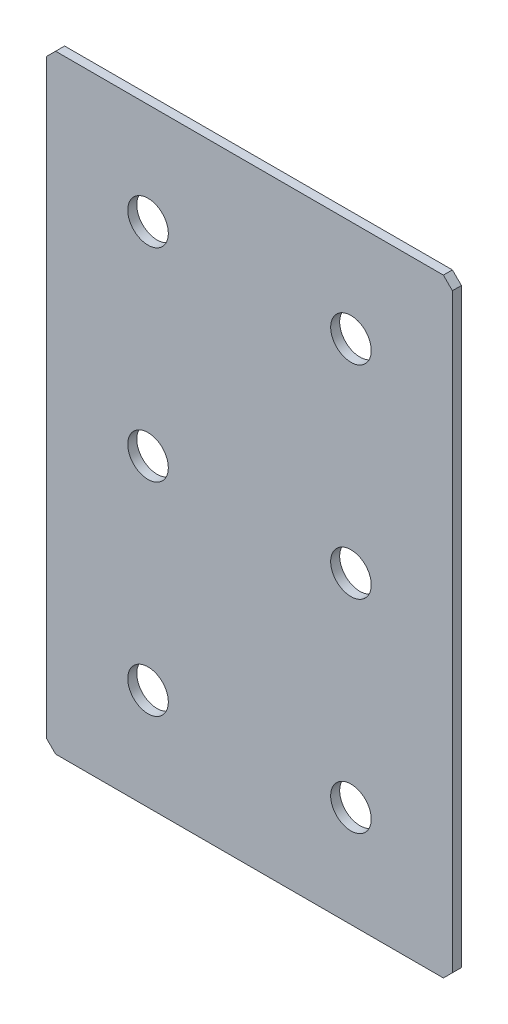
ISO-10303-21;
HEADER;
FILE_DESCRIPTION(('STEP AP214'),'2;1');
FILE_NAME('part.step','',(''),(''),'','','');
FILE_SCHEMA(('AUTOMOTIVE_DESIGN { 1 0 10303 214 1 1 1 1 }'));
ENDSEC;
DATA;
#1=APPLICATION_CONTEXT('core data for automotive mechanical design processes');
#2=APPLICATION_PROTOCOL_DEFINITION('international standard','automotive_design',2000,#1);
#3=PRODUCT_CONTEXT('',#1,'mechanical');
#4=PRODUCT('Part','Part','',(#3));
#5=PRODUCT_RELATED_PRODUCT_CATEGORY('part','',(#4));
#6=PRODUCT_DEFINITION_FORMATION('','',#4);
#7=PRODUCT_DEFINITION_CONTEXT('part definition',#1,'design');
#8=PRODUCT_DEFINITION('design','',#6,#7);
#9=PRODUCT_DEFINITION_SHAPE('','',#8);
#10=(LENGTH_UNIT() NAMED_UNIT(*) SI_UNIT(.MILLI.,.METRE.));
#11=(NAMED_UNIT(*) PLANE_ANGLE_UNIT() SI_UNIT($,.RADIAN.));
#12=(NAMED_UNIT(*) SI_UNIT($,.STERADIAN.) SOLID_ANGLE_UNIT());
#13=UNCERTAINTY_MEASURE_WITH_UNIT(LENGTH_MEASURE(1.E-05),#10,'distance_accuracy_value','');
#14=(GEOMETRIC_REPRESENTATION_CONTEXT(3) GLOBAL_UNCERTAINTY_ASSIGNED_CONTEXT((#13)) GLOBAL_UNIT_ASSIGNED_CONTEXT((#10,
#11,#12)) REPRESENTATION_CONTEXT('',''));
#15=CARTESIAN_POINT('',(0.,0.,0.));
#16=DIRECTION('',(0.,0.,1.));
#17=DIRECTION('',(1.,0.,0.));
#18=AXIS2_PLACEMENT_3D('',#15,#16,#17);
#19=CARTESIAN_POINT('',(45.,-67.5,2.));
#20=DIRECTION('',(-1.,0.,0.));
#21=DIRECTION('',(0.,0.,1.));
#22=AXIS2_PLACEMENT_3D('',#19,#20,#21);
#23=PLANE('',#22);
#24=DIRECTION('',(0.,1.,0.));
#25=VECTOR('',#24,1.);
#26=CARTESIAN_POINT('',(45.,-67.5,2.));
#27=LINE('',#26,#25);
#28=CARTESIAN_POINT('',(45.,-65.5000000000001,2.));
#29=VERTEX_POINT('',#28);
#30=CARTESIAN_POINT('',(45.,65.5,2.));
#31=VERTEX_POINT('',#30);
#32=EDGE_CURVE('E136',#29,#31,#27,.T.);
#33=ORIENTED_EDGE('',*,*,#32,.F.);
#34=DIRECTION('',(0.,0.,-1.));
#35=VECTOR('',#34,1.);
#36=CARTESIAN_POINT('',(45.,-65.5000000000001,2.));
#37=LINE('',#36,#35);
#38=CARTESIAN_POINT('',(45.,-65.5000000000001,0.));
#39=VERTEX_POINT('',#38);
#40=EDGE_CURVE('E177',#29,#39,#37,.T.);
#41=ORIENTED_EDGE('',*,*,#40,.T.);
#42=DIRECTION('',(0.,1.,0.));
#43=VECTOR('',#42,1.);
#44=CARTESIAN_POINT('',(45.,-67.5,0.));
#45=LINE('',#44,#43);
#46=CARTESIAN_POINT('',(45.,65.5,0.));
#47=VERTEX_POINT('',#46);
#48=EDGE_CURVE('E189',#39,#47,#45,.T.);
#49=ORIENTED_EDGE('',*,*,#48,.T.);
#50=DIRECTION('',(0.,0.,1.));
#51=VECTOR('',#50,1.);
#52=CARTESIAN_POINT('',(45.,65.5,2.));
#53=LINE('',#52,#51);
#54=EDGE_CURVE('E174',#47,#31,#53,.T.);
#55=ORIENTED_EDGE('',*,*,#54,.T.);
#56=EDGE_LOOP('',(#33,#41,#49,#55));
#57=FACE_BOUND('',#56,.T.);
#58=ADVANCED_FACE('F41',(#57),#23,.F.);
#59=CARTESIAN_POINT('',(-45.,67.5,2.));
#60=DIRECTION('',(0.,-1.,0.));
#61=DIRECTION('',(0.,0.,-1.));
#62=AXIS2_PLACEMENT_3D('',#59,#60,#61);
#63=PLANE('',#62);
#64=DIRECTION('',(-1.,0.,0.));
#65=VECTOR('',#64,1.);
#66=CARTESIAN_POINT('',(-45.,67.5,0.));
#67=LINE('',#66,#65);
#68=CARTESIAN_POINT('',(43.,67.5,0.));
#69=VERTEX_POINT('',#68);
#70=CARTESIAN_POINT('',(-43.,67.5,0.));
#71=VERTEX_POINT('',#70);
#72=EDGE_CURVE('E145',#69,#71,#67,.T.);
#73=ORIENTED_EDGE('',*,*,#72,.T.);
#74=DIRECTION('',(0.,0.,1.));
#75=VECTOR('',#74,1.);
#76=CARTESIAN_POINT('',(-43.,67.5,2.));
#77=LINE('',#76,#75);
#78=CARTESIAN_POINT('',(-43.,67.5,2.));
#79=VERTEX_POINT('',#78);
#80=EDGE_CURVE('E11',#71,#79,#77,.T.);
#81=ORIENTED_EDGE('',*,*,#80,.T.);
#82=DIRECTION('',(-1.,0.,0.));
#83=VECTOR('',#82,1.);
#84=CARTESIAN_POINT('',(-45.,67.5,2.));
#85=LINE('',#84,#83);
#86=CARTESIAN_POINT('',(43.,67.5,2.));
#87=VERTEX_POINT('',#86);
#88=EDGE_CURVE('E142',#87,#79,#85,.T.);
#89=ORIENTED_EDGE('',*,*,#88,.F.);
#90=DIRECTION('',(0.,0.,-1.));
#91=VECTOR('',#90,1.);
#92=CARTESIAN_POINT('',(43.,67.5,2.));
#93=LINE('',#92,#91);
#94=EDGE_CURVE('E50',#87,#69,#93,.T.);
#95=ORIENTED_EDGE('',*,*,#94,.T.);
#96=EDGE_LOOP('',(#73,#81,#89,#95));
#97=FACE_BOUND('',#96,.T.);
#98=ADVANCED_FACE('F185',(#97),#63,.F.);
#99=CARTESIAN_POINT('',(-45.,-67.5,2.));
#100=DIRECTION('',(1.,0.,0.));
#101=DIRECTION('',(0.,0.,-1.));
#102=AXIS2_PLACEMENT_3D('',#99,#100,#101);
#103=PLANE('',#102);
#104=DIRECTION('',(0.,-1.,0.));
#105=VECTOR('',#104,1.);
#106=CARTESIAN_POINT('',(-45.,-67.5,0.));
#107=LINE('',#106,#105);
#108=CARTESIAN_POINT('',(-45.,65.5,0.));
#109=VERTEX_POINT('',#108);
#110=CARTESIAN_POINT('',(-45.,-65.5,0.));
#111=VERTEX_POINT('',#110);
#112=EDGE_CURVE('E137',#109,#111,#107,.T.);
#113=ORIENTED_EDGE('',*,*,#112,.T.);
#114=DIRECTION('',(0.,0.,1.));
#115=VECTOR('',#114,1.);
#116=CARTESIAN_POINT('',(-45.,-65.5,2.));
#117=LINE('',#116,#115);
#118=CARTESIAN_POINT('',(-45.,-65.5,2.));
#119=VERTEX_POINT('',#118);
#120=EDGE_CURVE('E112',#111,#119,#117,.T.);
#121=ORIENTED_EDGE('',*,*,#120,.T.);
#122=DIRECTION('',(0.,-1.,0.));
#123=VECTOR('',#122,1.);
#124=CARTESIAN_POINT('',(-45.,-67.5,2.));
#125=LINE('',#124,#123);
#126=CARTESIAN_POINT('',(-45.,65.5,2.));
#127=VERTEX_POINT('',#126);
#128=EDGE_CURVE('E195',#127,#119,#125,.T.);
#129=ORIENTED_EDGE('',*,*,#128,.F.);
#130=DIRECTION('',(0.,0.,-1.));
#131=VECTOR('',#130,1.);
#132=CARTESIAN_POINT('',(-45.,65.5,2.));
#133=LINE('',#132,#131);
#134=EDGE_CURVE('E118',#127,#109,#133,.T.);
#135=ORIENTED_EDGE('',*,*,#134,.T.);
#136=EDGE_LOOP('',(#113,#121,#129,#135));
#137=FACE_BOUND('',#136,.T.);
#138=ADVANCED_FACE('F266',(#137),#103,.F.);
#139=CARTESIAN_POINT('',(-45.,-67.5,2.));
#140=DIRECTION('',(0.,1.,0.));
#141=DIRECTION('',(0.,0.,1.));
#142=AXIS2_PLACEMENT_3D('',#139,#140,#141);
#143=PLANE('',#142);
#144=DIRECTION('',(1.,0.,0.));
#145=VECTOR('',#144,1.);
#146=CARTESIAN_POINT('',(-45.,-67.5,2.));
#147=LINE('',#146,#145);
#148=CARTESIAN_POINT('',(-43.,-67.5,2.));
#149=VERTEX_POINT('',#148);
#150=CARTESIAN_POINT('',(43.,-67.5,2.));
#151=VERTEX_POINT('',#150);
#152=EDGE_CURVE('E128',#149,#151,#147,.T.);
#153=ORIENTED_EDGE('',*,*,#152,.F.);
#154=DIRECTION('',(0.,0.,-1.));
#155=VECTOR('',#154,1.);
#156=CARTESIAN_POINT('',(-43.,-67.5,2.));
#157=LINE('',#156,#155);
#158=CARTESIAN_POINT('',(-43.,-67.5,0.));
#159=VERTEX_POINT('',#158);
#160=EDGE_CURVE('E111',#149,#159,#157,.T.);
#161=ORIENTED_EDGE('',*,*,#160,.T.);
#162=DIRECTION('',(1.,0.,0.));
#163=VECTOR('',#162,1.);
#164=CARTESIAN_POINT('',(-45.,-67.5,0.));
#165=LINE('',#164,#163);
#166=CARTESIAN_POINT('',(43.,-67.5,0.));
#167=VERTEX_POINT('',#166);
#168=EDGE_CURVE('E125',#159,#167,#165,.T.);
#169=ORIENTED_EDGE('',*,*,#168,.T.);
#170=DIRECTION('',(0.,0.,1.));
#171=VECTOR('',#170,1.);
#172=CARTESIAN_POINT('',(43.,-67.5,2.));
#173=LINE('',#172,#171);
#174=EDGE_CURVE('E131',#167,#151,#173,.T.);
#175=ORIENTED_EDGE('',*,*,#174,.T.);
#176=EDGE_LOOP('',(#153,#161,#169,#175));
#177=FACE_BOUND('',#176,.T.);
#178=ADVANCED_FACE('F124',(#177),#143,.F.);
#179=CARTESIAN_POINT('',(0.,0.,2.));
#180=DIRECTION('',(0.,0.,-1.));
#181=DIRECTION('',(-1.,0.,0.));
#182=AXIS2_PLACEMENT_3D('',#179,#180,#181);
#183=PLANE('',#182);
#184=CARTESIAN_POINT('',(-22.5,45.,2.));
#185=DIRECTION('',(0.,0.,1.));
#186=DIRECTION('',(1.,0.,0.));
#187=AXIS2_PLACEMENT_3D('',#184,#185,#186);
#188=CIRCLE('',#187,4.49999999999999);
#189=CARTESIAN_POINT('',(-18.,45.,2.));
#190=VERTEX_POINT('',#189);
#191=EDGE_CURVE('E243',#190,#190,#188,.T.);
#192=ORIENTED_EDGE('',*,*,#191,.F.);
#193=EDGE_LOOP('',(#192));
#194=FACE_BOUND('',#193,.T.);
#195=CARTESIAN_POINT('',(22.5,45.,2.));
#196=DIRECTION('',(0.,0.,1.));
#197=DIRECTION('',(1.,0.,0.));
#198=AXIS2_PLACEMENT_3D('',#195,#196,#197);
#199=CIRCLE('',#198,4.49999999999999);
#200=CARTESIAN_POINT('',(27.,45.,2.));
#201=VERTEX_POINT('',#200);
#202=EDGE_CURVE('E235',#201,#201,#199,.T.);
#203=ORIENTED_EDGE('',*,*,#202,.F.);
#204=EDGE_LOOP('',(#203));
#205=FACE_BOUND('',#204,.T.);
#206=CARTESIAN_POINT('',(22.5,0.,2.));
#207=DIRECTION('',(0.,0.,1.));
#208=DIRECTION('',(1.,0.,0.));
#209=AXIS2_PLACEMENT_3D('',#206,#207,#208);
#210=CIRCLE('',#209,4.49999999999999);
#211=CARTESIAN_POINT('',(27.,0.,2.));
#212=VERTEX_POINT('',#211);
#213=EDGE_CURVE('E227',#212,#212,#210,.T.);
#214=ORIENTED_EDGE('',*,*,#213,.F.);
#215=EDGE_LOOP('',(#214));
#216=FACE_BOUND('',#215,.T.);
#217=CARTESIAN_POINT('',(-22.5,0.,2.));
#218=DIRECTION('',(0.,0.,1.));
#219=DIRECTION('',(1.,0.,0.));
#220=AXIS2_PLACEMENT_3D('',#217,#218,#219);
#221=CIRCLE('',#220,4.49999999999999);
#222=CARTESIAN_POINT('',(-18.,0.,2.));
#223=VERTEX_POINT('',#222);
#224=EDGE_CURVE('E219',#223,#223,#221,.T.);
#225=ORIENTED_EDGE('',*,*,#224,.F.);
#226=EDGE_LOOP('',(#225));
#227=FACE_BOUND('',#226,.T.);
#228=CARTESIAN_POINT('',(-22.5,-45.,2.));
#229=DIRECTION('',(0.,0.,1.));
#230=DIRECTION('',(1.,0.,0.));
#231=AXIS2_PLACEMENT_3D('',#228,#229,#230);
#232=CIRCLE('',#231,4.49999999999999);
#233=CARTESIAN_POINT('',(-18.,-45.,2.));
#234=VERTEX_POINT('',#233);
#235=EDGE_CURVE('E212',#234,#234,#232,.T.);
#236=ORIENTED_EDGE('',*,*,#235,.F.);
#237=EDGE_LOOP('',(#236));
#238=FACE_BOUND('',#237,.T.);
#239=CARTESIAN_POINT('',(22.5,-45.,2.));
#240=DIRECTION('',(0.,0.,1.));
#241=DIRECTION('',(1.,0.,0.));
#242=AXIS2_PLACEMENT_3D('',#239,#240,#241);
#243=CIRCLE('',#242,4.49999999999999);
#244=CARTESIAN_POINT('',(27.,-45.,2.));
#245=VERTEX_POINT('',#244);
#246=EDGE_CURVE('E204',#245,#245,#243,.T.);
#247=ORIENTED_EDGE('',*,*,#246,.F.);
#248=EDGE_LOOP('',(#247));
#249=FACE_BOUND('',#248,.T.);
#250=ORIENTED_EDGE('',*,*,#128,.T.);
#251=DIRECTION('',(-0.707106781186548,0.707106781186548,0.));
#252=VECTOR('',#251,1.);
#253=CARTESIAN_POINT('',(-43.,-67.5,2.));
#254=LINE('',#253,#252);
#255=EDGE_CURVE('E171',#119,#149,#254,.F.);
#256=ORIENTED_EDGE('',*,*,#255,.T.);
#257=ORIENTED_EDGE('',*,*,#152,.T.);
#258=DIRECTION('',(-0.70710678118655,-0.707106781186545,0.));
#259=VECTOR('',#258,1.);
#260=CARTESIAN_POINT('',(45.,-65.5000000000001,2.));
#261=LINE('',#260,#259);
#262=EDGE_CURVE('E168',#151,#29,#261,.F.);
#263=ORIENTED_EDGE('',*,*,#262,.T.);
#264=ORIENTED_EDGE('',*,*,#32,.T.);
#265=DIRECTION('',(0.707106781186545,-0.70710678118655,0.));
#266=VECTOR('',#265,1.);
#267=CARTESIAN_POINT('',(43.,67.5,2.));
#268=LINE('',#267,#266);
#269=EDGE_CURVE('E62',#31,#87,#268,.F.);
#270=ORIENTED_EDGE('',*,*,#269,.T.);
#271=ORIENTED_EDGE('',*,*,#88,.T.);
#272=DIRECTION('',(0.707106781186555,0.70710678118654,0.));
#273=VECTOR('',#272,1.);
#274=CARTESIAN_POINT('',(-45.,65.5,2.));
#275=LINE('',#274,#273);
#276=EDGE_CURVE('E165',#79,#127,#275,.F.);
#277=ORIENTED_EDGE('',*,*,#276,.T.);
#278=EDGE_LOOP('',(#250,#256,#257,#263,#264,#270,#271,#277));
#279=FACE_BOUND('',#278,.T.);
#280=ADVANCED_FACE('F249',(#194,#205,#216,#227,#238,#249,#279),#183,.F.);
#281=CARTESIAN_POINT('',(0.,0.,0.));
#282=DIRECTION('',(0.,0.,-1.));
#283=DIRECTION('',(-1.,0.,0.));
#284=AXIS2_PLACEMENT_3D('',#281,#282,#283);
#285=PLANE('',#284);
#286=CARTESIAN_POINT('',(-22.5,45.,0.));
#287=DIRECTION('',(0.,0.,1.));
#288=DIRECTION('',(1.,0.,0.));
#289=AXIS2_PLACEMENT_3D('',#286,#287,#288);
#290=CIRCLE('',#289,4.49999999999999);
#291=CARTESIAN_POINT('',(-18.,45.,0.));
#292=VERTEX_POINT('',#291);
#293=EDGE_CURVE('E239',#292,#292,#290,.T.);
#294=ORIENTED_EDGE('',*,*,#293,.T.);
#295=EDGE_LOOP('',(#294));
#296=FACE_BOUND('',#295,.T.);
#297=CARTESIAN_POINT('',(22.5,45.,0.));
#298=DIRECTION('',(0.,0.,1.));
#299=DIRECTION('',(1.,0.,0.));
#300=AXIS2_PLACEMENT_3D('',#297,#298,#299);
#301=CIRCLE('',#300,4.49999999999999);
#302=CARTESIAN_POINT('',(27.,45.,0.));
#303=VERTEX_POINT('',#302);
#304=EDGE_CURVE('E231',#303,#303,#301,.T.);
#305=ORIENTED_EDGE('',*,*,#304,.T.);
#306=EDGE_LOOP('',(#305));
#307=FACE_BOUND('',#306,.T.);
#308=CARTESIAN_POINT('',(22.5,0.,0.));
#309=DIRECTION('',(0.,0.,1.));
#310=DIRECTION('',(1.,0.,0.));
#311=AXIS2_PLACEMENT_3D('',#308,#309,#310);
#312=CIRCLE('',#311,4.49999999999999);
#313=CARTESIAN_POINT('',(27.,0.,0.));
#314=VERTEX_POINT('',#313);
#315=EDGE_CURVE('E223',#314,#314,#312,.T.);
#316=ORIENTED_EDGE('',*,*,#315,.T.);
#317=EDGE_LOOP('',(#316));
#318=FACE_BOUND('',#317,.T.);
#319=CARTESIAN_POINT('',(-22.5,0.,0.));
#320=DIRECTION('',(0.,0.,1.));
#321=DIRECTION('',(1.,0.,0.));
#322=AXIS2_PLACEMENT_3D('',#319,#320,#321);
#323=CIRCLE('',#322,4.49999999999999);
#324=CARTESIAN_POINT('',(-18.,0.,0.));
#325=VERTEX_POINT('',#324);
#326=EDGE_CURVE('E215',#325,#325,#323,.T.);
#327=ORIENTED_EDGE('',*,*,#326,.T.);
#328=EDGE_LOOP('',(#327));
#329=FACE_BOUND('',#328,.T.);
#330=CARTESIAN_POINT('',(-22.5,-45.,0.));
#331=DIRECTION('',(0.,0.,1.));
#332=DIRECTION('',(1.,0.,0.));
#333=AXIS2_PLACEMENT_3D('',#330,#331,#332);
#334=CIRCLE('',#333,4.49999999999999);
#335=CARTESIAN_POINT('',(-18.,-45.,0.));
#336=VERTEX_POINT('',#335);
#337=EDGE_CURVE('E208',#336,#336,#334,.T.);
#338=ORIENTED_EDGE('',*,*,#337,.T.);
#339=EDGE_LOOP('',(#338));
#340=FACE_BOUND('',#339,.T.);
#341=CARTESIAN_POINT('',(22.5,-45.,0.));
#342=DIRECTION('',(0.,0.,1.));
#343=DIRECTION('',(1.,0.,0.));
#344=AXIS2_PLACEMENT_3D('',#341,#342,#343);
#345=CIRCLE('',#344,4.49999999999999);
#346=CARTESIAN_POINT('',(27.,-45.,0.));
#347=VERTEX_POINT('',#346);
#348=EDGE_CURVE('E191',#347,#347,#345,.T.);
#349=ORIENTED_EDGE('',*,*,#348,.T.);
#350=EDGE_LOOP('',(#349));
#351=FACE_BOUND('',#350,.T.);
#352=ORIENTED_EDGE('',*,*,#168,.F.);
#353=DIRECTION('',(0.707106781186548,-0.707106781186548,0.));
#354=VECTOR('',#353,1.);
#355=CARTESIAN_POINT('',(-55.25,-55.25,0.));
#356=LINE('',#355,#354);
#357=EDGE_CURVE('E107',#159,#111,#356,.F.);
#358=ORIENTED_EDGE('',*,*,#357,.T.);
#359=ORIENTED_EDGE('',*,*,#112,.F.);
#360=DIRECTION('',(-0.707106781186555,-0.70710678118654,0.));
#361=VECTOR('',#360,1.);
#362=CARTESIAN_POINT('',(-55.2499999999995,55.2500000000007,0.));
#363=LINE('',#362,#361);
#364=EDGE_CURVE('E153',#109,#71,#363,.F.);
#365=ORIENTED_EDGE('',*,*,#364,.T.);
#366=ORIENTED_EDGE('',*,*,#72,.F.);
#367=DIRECTION('',(-0.707106781186545,0.70710678118655,0.));
#368=VECTOR('',#367,1.);
#369=CARTESIAN_POINT('',(55.2500000000001,55.2499999999998,0.));
#370=LINE('',#369,#368);
#371=EDGE_CURVE('E130',#69,#47,#370,.F.);
#372=ORIENTED_EDGE('',*,*,#371,.T.);
#373=ORIENTED_EDGE('',*,*,#48,.F.);
#374=DIRECTION('',(0.70710678118655,0.707106781186545,0.));
#375=VECTOR('',#374,1.);
#376=CARTESIAN_POINT('',(55.2499999999999,-55.2500000000003,0.));
#377=LINE('',#376,#375);
#378=EDGE_CURVE('E119',#39,#167,#377,.F.);
#379=ORIENTED_EDGE('',*,*,#378,.T.);
#380=EDGE_LOOP('',(#352,#358,#359,#365,#366,#372,#373,#379));
#381=FACE_BOUND('',#380,.T.);
#382=ADVANCED_FACE('F133',(#296,#307,#318,#329,#340,#351,#381),#285,.T.);
#383=CARTESIAN_POINT('',(-43.,-67.5,2.));
#384=DIRECTION('',(0.707106781186547,0.707106781186547,0.));
#385=DIRECTION('',(0.,0.,-1.));
#386=AXIS2_PLACEMENT_3D('',#383,#384,#385);
#387=PLANE('',#386);
#388=ORIENTED_EDGE('',*,*,#255,.F.);
#389=ORIENTED_EDGE('',*,*,#120,.F.);
#390=ORIENTED_EDGE('',*,*,#357,.F.);
#391=ORIENTED_EDGE('',*,*,#160,.F.);
#392=EDGE_LOOP('',(#388,#389,#390,#391));
#393=FACE_BOUND('',#392,.T.);
#394=ADVANCED_FACE('F110',(#393),#387,.F.);
#395=CARTESIAN_POINT('',(45.,-65.5000000000001,2.));
#396=DIRECTION('',(-0.707106781186545,0.70710678118655,0.));
#397=DIRECTION('',(0.,0.,-1.));
#398=AXIS2_PLACEMENT_3D('',#395,#396,#397);
#399=PLANE('',#398);
#400=ORIENTED_EDGE('',*,*,#262,.F.);
#401=ORIENTED_EDGE('',*,*,#174,.F.);
#402=ORIENTED_EDGE('',*,*,#378,.F.);
#403=ORIENTED_EDGE('',*,*,#40,.F.);
#404=EDGE_LOOP('',(#400,#401,#402,#403));
#405=FACE_BOUND('',#404,.T.);
#406=ADVANCED_FACE('F270',(#405),#399,.F.);
#407=CARTESIAN_POINT('',(-45.,65.5,2.));
#408=DIRECTION('',(0.70710678118654,-0.707106781186555,0.));
#409=DIRECTION('',(0.,0.,-1.));
#410=AXIS2_PLACEMENT_3D('',#407,#408,#409);
#411=PLANE('',#410);
#412=ORIENTED_EDGE('',*,*,#276,.F.);
#413=ORIENTED_EDGE('',*,*,#80,.F.);
#414=ORIENTED_EDGE('',*,*,#364,.F.);
#415=ORIENTED_EDGE('',*,*,#134,.F.);
#416=EDGE_LOOP('',(#412,#413,#414,#415));
#417=FACE_BOUND('',#416,.T.);
#418=ADVANCED_FACE('F268',(#417),#411,.F.);
#419=CARTESIAN_POINT('',(43.,67.5,2.));
#420=DIRECTION('',(-0.70710678118655,-0.707106781186545,0.));
#421=DIRECTION('',(0.,0.,-1.));
#422=AXIS2_PLACEMENT_3D('',#419,#420,#421);
#423=PLANE('',#422);
#424=ORIENTED_EDGE('',*,*,#269,.F.);
#425=ORIENTED_EDGE('',*,*,#54,.F.);
#426=ORIENTED_EDGE('',*,*,#371,.F.);
#427=ORIENTED_EDGE('',*,*,#94,.F.);
#428=EDGE_LOOP('',(#424,#425,#426,#427));
#429=FACE_BOUND('',#428,.T.);
#430=ADVANCED_FACE('F43',(#429),#423,.F.);
#431=CARTESIAN_POINT('',(22.5,-45.,2.));
#432=DIRECTION('',(0.,0.,1.));
#433=DIRECTION('',(1.,0.,0.));
#434=AXIS2_PLACEMENT_3D('',#431,#432,#433);
#435=CYLINDRICAL_SURFACE('',#434,4.49999999999999);
#436=ORIENTED_EDGE('',*,*,#348,.F.);
#437=EDGE_LOOP('',(#436));
#438=FACE_BOUND('',#437,.T.);
#439=ORIENTED_EDGE('',*,*,#246,.T.);
#440=EDGE_LOOP('',(#439));
#441=FACE_BOUND('',#440,.T.);
#442=ADVANCED_FACE('F275',(#438,#441),#435,.F.);
#443=CARTESIAN_POINT('',(-22.5,-45.,2.));
#444=DIRECTION('',(0.,0.,1.));
#445=DIRECTION('',(1.,0.,0.));
#446=AXIS2_PLACEMENT_3D('',#443,#444,#445);
#447=CYLINDRICAL_SURFACE('',#446,4.49999999999999);
#448=ORIENTED_EDGE('',*,*,#337,.F.);
#449=EDGE_LOOP('',(#448));
#450=FACE_BOUND('',#449,.T.);
#451=ORIENTED_EDGE('',*,*,#235,.T.);
#452=EDGE_LOOP('',(#451));
#453=FACE_BOUND('',#452,.T.);
#454=ADVANCED_FACE('F337',(#450,#453),#447,.F.);
#455=CARTESIAN_POINT('',(-22.5,0.,2.));
#456=DIRECTION('',(0.,0.,1.));
#457=DIRECTION('',(1.,0.,0.));
#458=AXIS2_PLACEMENT_3D('',#455,#456,#457);
#459=CYLINDRICAL_SURFACE('',#458,4.49999999999999);
#460=ORIENTED_EDGE('',*,*,#326,.F.);
#461=EDGE_LOOP('',(#460));
#462=FACE_BOUND('',#461,.T.);
#463=ORIENTED_EDGE('',*,*,#224,.T.);
#464=EDGE_LOOP('',(#463));
#465=FACE_BOUND('',#464,.T.);
#466=ADVANCED_FACE('F345',(#462,#465),#459,.F.);
#467=CARTESIAN_POINT('',(22.5,0.,2.));
#468=DIRECTION('',(0.,0.,1.));
#469=DIRECTION('',(1.,0.,0.));
#470=AXIS2_PLACEMENT_3D('',#467,#468,#469);
#471=CYLINDRICAL_SURFACE('',#470,4.49999999999999);
#472=ORIENTED_EDGE('',*,*,#315,.F.);
#473=EDGE_LOOP('',(#472));
#474=FACE_BOUND('',#473,.T.);
#475=ORIENTED_EDGE('',*,*,#213,.T.);
#476=EDGE_LOOP('',(#475));
#477=FACE_BOUND('',#476,.T.);
#478=ADVANCED_FACE('F354',(#474,#477),#471,.F.);
#479=CARTESIAN_POINT('',(22.5,45.,2.));
#480=DIRECTION('',(0.,0.,1.));
#481=DIRECTION('',(1.,0.,0.));
#482=AXIS2_PLACEMENT_3D('',#479,#480,#481);
#483=CYLINDRICAL_SURFACE('',#482,4.49999999999999);
#484=ORIENTED_EDGE('',*,*,#304,.F.);
#485=EDGE_LOOP('',(#484));
#486=FACE_BOUND('',#485,.T.);
#487=ORIENTED_EDGE('',*,*,#202,.T.);
#488=EDGE_LOOP('',(#487));
#489=FACE_BOUND('',#488,.T.);
#490=ADVANCED_FACE('F363',(#486,#489),#483,.F.);
#491=CARTESIAN_POINT('',(-22.5,45.,2.));
#492=DIRECTION('',(0.,0.,1.));
#493=DIRECTION('',(1.,0.,0.));
#494=AXIS2_PLACEMENT_3D('',#491,#492,#493);
#495=CYLINDRICAL_SURFACE('',#494,4.49999999999999);
#496=ORIENTED_EDGE('',*,*,#293,.F.);
#497=EDGE_LOOP('',(#496));
#498=FACE_BOUND('',#497,.T.);
#499=ORIENTED_EDGE('',*,*,#191,.T.);
#500=EDGE_LOOP('',(#499));
#501=FACE_BOUND('',#500,.T.);
#502=ADVANCED_FACE('F247',(#498,#501),#495,.F.);
#503=CLOSED_SHELL('',(#58,#98,#138,#178,#280,#382,#394,#406,#418,#430,#442,#454,#466,#478,#490,#502));
#504=MANIFOLD_SOLID_BREP('B2',#503);
#505=ADVANCED_BREP_SHAPE_REPRESENTATION('',(#18,#504),#14);
#506=SHAPE_DEFINITION_REPRESENTATION(#9,#505);
ENDSEC;
END-ISO-10303-21;
